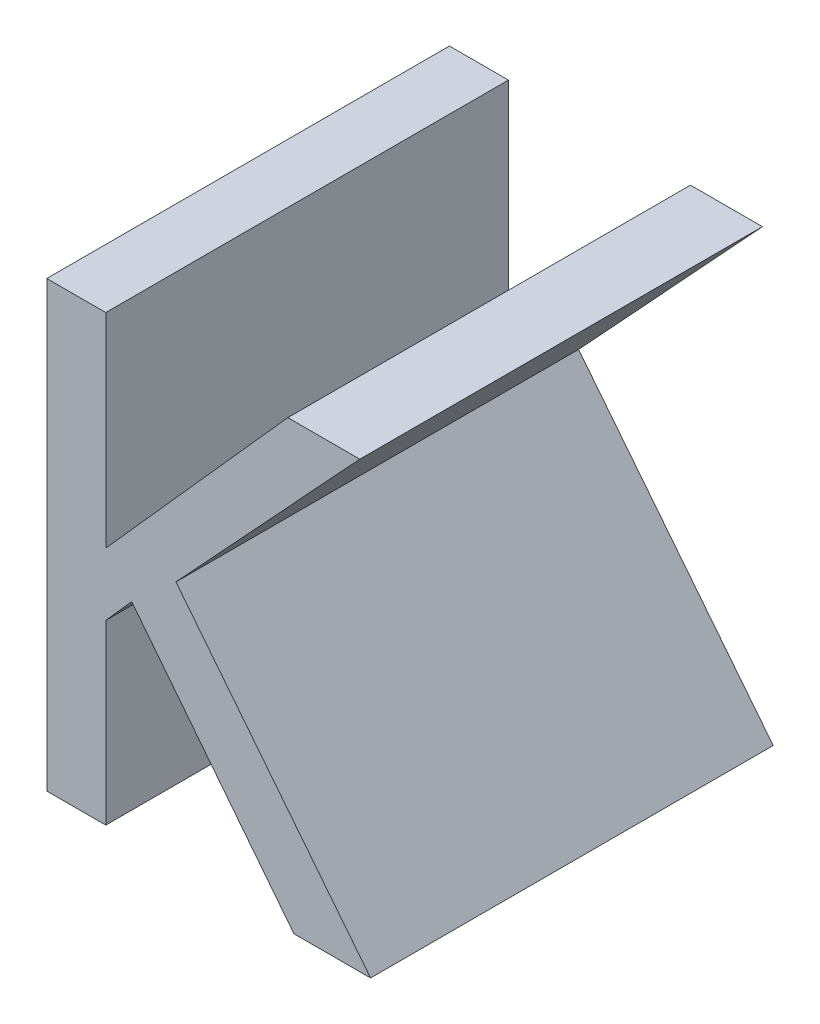
ISO-10303-21;
HEADER;
FILE_DESCRIPTION(('STEP AP214'),'2;1');
FILE_NAME('part.step','',(''),(''),'','','');
FILE_SCHEMA(('AUTOMOTIVE_DESIGN { 1 0 10303 214 1 1 1 1 }'));
ENDSEC;
DATA;
#1=APPLICATION_CONTEXT('core data for automotive mechanical design processes');
#2=APPLICATION_PROTOCOL_DEFINITION('international standard','automotive_design',2000,#1);
#3=PRODUCT_CONTEXT('',#1,'mechanical');
#4=PRODUCT('Part','Part','',(#3));
#5=PRODUCT_RELATED_PRODUCT_CATEGORY('part','',(#4));
#6=PRODUCT_DEFINITION_FORMATION('','',#4);
#7=PRODUCT_DEFINITION_CONTEXT('part definition',#1,'design');
#8=PRODUCT_DEFINITION('design','',#6,#7);
#9=PRODUCT_DEFINITION_SHAPE('','',#8);
#10=(LENGTH_UNIT() NAMED_UNIT(*) SI_UNIT(.MILLI.,.METRE.));
#11=(NAMED_UNIT(*) PLANE_ANGLE_UNIT() SI_UNIT($,.RADIAN.));
#12=(NAMED_UNIT(*) SI_UNIT($,.STERADIAN.) SOLID_ANGLE_UNIT());
#13=UNCERTAINTY_MEASURE_WITH_UNIT(LENGTH_MEASURE(1.E-05),#10,'distance_accuracy_value','');
#14=(GEOMETRIC_REPRESENTATION_CONTEXT(3) GLOBAL_UNCERTAINTY_ASSIGNED_CONTEXT((#13)) GLOBAL_UNIT_ASSIGNED_CONTEXT((#10,
#11,#12)) REPRESENTATION_CONTEXT('',''));
#15=CARTESIAN_POINT('',(0.,0.,0.));
#16=DIRECTION('',(0.,0.,1.));
#17=DIRECTION('',(1.,0.,0.));
#18=AXIS2_PLACEMENT_3D('',#15,#16,#17);
#19=CARTESIAN_POINT('',(-0.505727080254075,-0.750246731700096,0.));
#20=DIRECTION('',(-0.786318338822422,-0.617821551931904,0.));
#21=DIRECTION('',(0.617821551931904,-0.786318338822422,0.));
#22=AXIS2_PLACEMENT_3D('',#19,#20,#21);
#23=PLANE('',#22);
#24=DIRECTION('',(-0.617821551931904,0.786318338822422,0.));
#25=VECTOR('',#24,1.);
#26=CARTESIAN_POINT('',(-0.465433116202386,-0.801529958674972,0.));
#27=LINE('',#26,#25);
#28=CARTESIAN_POINT('',(-0.465433116202386,-0.801529958674972,0.));
#29=VERTEX_POINT('',#28);
#30=CARTESIAN_POINT('',(-0.505727080254075,-0.750246731700096,0.));
#31=VERTEX_POINT('',#30);
#32=EDGE_CURVE('E11',#29,#31,#27,.T.);
#33=ORIENTED_EDGE('',*,*,#32,.F.);
#34=DIRECTION('',(0.,0.,1.));
#35=VECTOR('',#34,1.);
#36=CARTESIAN_POINT('',(-0.465433116202386,-0.801529958674972,0.));
#37=LINE('',#36,#35);
#38=CARTESIAN_POINT('',(-0.465433116202386,-0.801529958674972,0.1));
#39=VERTEX_POINT('',#38);
#40=EDGE_CURVE('E201',#29,#39,#37,.T.);
#41=ORIENTED_EDGE('',*,*,#40,.T.);
#42=DIRECTION('',(0.617821551931903,-0.786318338822423,0.));
#43=VECTOR('',#42,1.);
#44=CARTESIAN_POINT('',(-0.505727080254075,-0.750246731700096,0.1));
#45=LINE('',#44,#43);
#46=CARTESIAN_POINT('',(-0.505727080254075,-0.750246731700096,0.1));
#47=VERTEX_POINT('',#46);
#48=EDGE_CURVE('E127',#47,#39,#45,.T.);
#49=ORIENTED_EDGE('',*,*,#48,.F.);
#50=DIRECTION('',(0.,0.,1.));
#51=VECTOR('',#50,1.);
#52=CARTESIAN_POINT('',(-0.505727080254075,-0.750246731700096,0.));
#53=LINE('',#52,#51);
#54=EDGE_CURVE('E196',#31,#47,#53,.T.);
#55=ORIENTED_EDGE('',*,*,#54,.F.);
#56=EDGE_LOOP('',(#33,#41,#49,#55));
#57=FACE_BOUND('',#56,.T.);
#58=ADVANCED_FACE('F17',(#57),#23,.T.);
#59=CARTESIAN_POINT('',(-0.512159819526185,-0.757483563381219,0.));
#60=DIRECTION('',(0.747409318683659,-0.664363838829921,0.));
#61=DIRECTION('',(0.664363838829921,0.747409318683659,0.));
#62=AXIS2_PLACEMENT_3D('',#59,#60,#61);
#63=PLANE('',#62);
#64=DIRECTION('',(-0.66436383882992,-0.747409318683659,0.));
#65=VECTOR('',#64,1.);
#66=CARTESIAN_POINT('',(-0.505727080254075,-0.750246731700096,0.));
#67=LINE('',#66,#65);
#68=CARTESIAN_POINT('',(-0.512159819526185,-0.757483563381219,0.));
#69=VERTEX_POINT('',#68);
#70=EDGE_CURVE('E24',#31,#69,#67,.T.);
#71=ORIENTED_EDGE('',*,*,#70,.F.);
#72=ORIENTED_EDGE('',*,*,#54,.T.);
#73=DIRECTION('',(0.664363838829926,0.747409318683654,0.));
#74=VECTOR('',#73,1.);
#75=CARTESIAN_POINT('',(-0.512159819526185,-0.757483563381219,0.1));
#76=LINE('',#75,#74);
#77=CARTESIAN_POINT('',(-0.512159819526185,-0.757483563381219,0.1));
#78=VERTEX_POINT('',#77);
#79=EDGE_CURVE('E188',#78,#47,#76,.T.);
#80=ORIENTED_EDGE('',*,*,#79,.F.);
#81=DIRECTION('',(0.,0.,1.));
#82=VECTOR('',#81,1.);
#83=CARTESIAN_POINT('',(-0.512159819526185,-0.757483563381219,0.));
#84=LINE('',#83,#82);
#85=EDGE_CURVE('E190',#69,#78,#84,.T.);
#86=ORIENTED_EDGE('',*,*,#85,.F.);
#87=EDGE_LOOP('',(#71,#72,#80,#86));
#88=FACE_BOUND('',#87,.T.);
#89=ADVANCED_FACE('F206',(#88),#63,.T.);
#90=CARTESIAN_POINT('',(-0.512159819526185,-0.801529958674972,0.));
#91=DIRECTION('',(1.,0.,0.));
#92=DIRECTION('',(0.,1.,0.));
#93=AXIS2_PLACEMENT_3D('',#90,#91,#92);
#94=PLANE('',#93);
#95=DIRECTION('',(0.,-1.,0.));
#96=VECTOR('',#95,1.);
#97=CARTESIAN_POINT('',(-0.512159819526185,-0.757483563381219,0.));
#98=LINE('',#97,#96);
#99=CARTESIAN_POINT('',(-0.512159819526185,-0.801529958674972,0.));
#100=VERTEX_POINT('',#99);
#101=EDGE_CURVE('E198',#69,#100,#98,.T.);
#102=ORIENTED_EDGE('',*,*,#101,.F.);
#103=ORIENTED_EDGE('',*,*,#85,.T.);
#104=DIRECTION('',(0.,1.,0.));
#105=VECTOR('',#104,1.);
#106=CARTESIAN_POINT('',(-0.512159819526185,-0.801529958674972,0.1));
#107=LINE('',#106,#105);
#108=CARTESIAN_POINT('',(-0.512159819526185,-0.801529958674972,0.1));
#109=VERTEX_POINT('',#108);
#110=EDGE_CURVE('E180',#109,#78,#107,.T.);
#111=ORIENTED_EDGE('',*,*,#110,.F.);
#112=DIRECTION('',(0.,0.,1.));
#113=VECTOR('',#112,1.);
#114=CARTESIAN_POINT('',(-0.512159819526185,-0.801529958674972,0.));
#115=LINE('',#114,#113);
#116=EDGE_CURVE('E183',#100,#109,#115,.T.);
#117=ORIENTED_EDGE('',*,*,#116,.F.);
#118=EDGE_LOOP('',(#102,#103,#111,#117));
#119=FACE_BOUND('',#118,.T.);
#120=ADVANCED_FACE('F208',(#119),#94,.T.);
#121=CARTESIAN_POINT('',(-0.526812170090435,-0.801529958674972,0.));
#122=DIRECTION('',(0.,-1.,0.));
#123=DIRECTION('',(1.,0.,0.));
#124=AXIS2_PLACEMENT_3D('',#121,#122,#123);
#125=PLANE('',#124);
#126=DIRECTION('',(-1.,0.,0.));
#127=VECTOR('',#126,1.);
#128=CARTESIAN_POINT('',(-0.512159819526185,-0.801529958674972,0.));
#129=LINE('',#128,#127);
#130=CARTESIAN_POINT('',(-0.526812170090435,-0.801529958674972,0.));
#131=VERTEX_POINT('',#130);
#132=EDGE_CURVE('E192',#100,#131,#129,.T.);
#133=ORIENTED_EDGE('',*,*,#132,.F.);
#134=ORIENTED_EDGE('',*,*,#116,.T.);
#135=DIRECTION('',(1.,0.,0.));
#136=VECTOR('',#135,1.);
#137=CARTESIAN_POINT('',(-0.526812170090435,-0.801529958674972,0.1));
#138=LINE('',#137,#136);
#139=CARTESIAN_POINT('',(-0.526812170090435,-0.801529958674972,0.1));
#140=VERTEX_POINT('',#139);
#141=EDGE_CURVE('E172',#140,#109,#138,.T.);
#142=ORIENTED_EDGE('',*,*,#141,.F.);
#143=DIRECTION('',(0.,0.,1.));
#144=VECTOR('',#143,1.);
#145=CARTESIAN_POINT('',(-0.526812170090435,-0.801529958674972,0.));
#146=LINE('',#145,#144);
#147=EDGE_CURVE('E175',#131,#140,#146,.T.);
#148=ORIENTED_EDGE('',*,*,#147,.F.);
#149=EDGE_LOOP('',(#133,#134,#142,#148));
#150=FACE_BOUND('',#149,.T.);
#151=ADVANCED_FACE('F212',(#150),#125,.T.);
#152=CARTESIAN_POINT('',(-0.526812170090435,-0.691279955039089,0.));
#153=DIRECTION('',(-1.,0.,0.));
#154=DIRECTION('',(0.,-1.,0.));
#155=AXIS2_PLACEMENT_3D('',#152,#153,#154);
#156=PLANE('',#155);
#157=DIRECTION('',(0.,1.,0.));
#158=VECTOR('',#157,1.);
#159=CARTESIAN_POINT('',(-0.526812170090435,-0.801529958674972,0.));
#160=LINE('',#159,#158);
#161=CARTESIAN_POINT('',(-0.526812170090435,-0.691279955039089,0.));
#162=VERTEX_POINT('',#161);
#163=EDGE_CURVE('E185',#131,#162,#160,.T.);
#164=ORIENTED_EDGE('',*,*,#163,.F.);
#165=ORIENTED_EDGE('',*,*,#147,.T.);
#166=DIRECTION('',(0.,-1.,0.));
#167=VECTOR('',#166,1.);
#168=CARTESIAN_POINT('',(-0.526812170090435,-0.691279955039089,0.1));
#169=LINE('',#168,#167);
#170=CARTESIAN_POINT('',(-0.526812170090435,-0.691279955039089,0.1));
#171=VERTEX_POINT('',#170);
#172=EDGE_CURVE('E164',#171,#140,#169,.T.);
#173=ORIENTED_EDGE('',*,*,#172,.F.);
#174=DIRECTION('',(0.,0.,1.));
#175=VECTOR('',#174,1.);
#176=CARTESIAN_POINT('',(-0.526812170090435,-0.691279955039089,0.));
#177=LINE('',#176,#175);
#178=EDGE_CURVE('E167',#162,#171,#177,.T.);
#179=ORIENTED_EDGE('',*,*,#178,.F.);
#180=EDGE_LOOP('',(#164,#165,#173,#179));
#181=FACE_BOUND('',#180,.T.);
#182=ADVANCED_FACE('F216',(#181),#156,.T.);
#183=CARTESIAN_POINT('',(-0.512159819526185,-0.691279955039089,0.));
#184=DIRECTION('',(0.,1.,0.));
#185=DIRECTION('',(-1.,0.,0.));
#186=AXIS2_PLACEMENT_3D('',#183,#184,#185);
#187=PLANE('',#186);
#188=DIRECTION('',(1.,0.,0.));
#189=VECTOR('',#188,1.);
#190=CARTESIAN_POINT('',(-0.526812170090435,-0.691279955039089,0.));
#191=LINE('',#190,#189);
#192=CARTESIAN_POINT('',(-0.512159819526185,-0.691279955039089,0.));
#193=VERTEX_POINT('',#192);
#194=EDGE_CURVE('E177',#162,#193,#191,.T.);
#195=ORIENTED_EDGE('',*,*,#194,.F.);
#196=ORIENTED_EDGE('',*,*,#178,.T.);
#197=DIRECTION('',(-1.,0.,0.));
#198=VECTOR('',#197,1.);
#199=CARTESIAN_POINT('',(-0.512159819526185,-0.691279955039089,0.1));
#200=LINE('',#199,#198);
#201=CARTESIAN_POINT('',(-0.512159819526185,-0.691279955039089,0.1));
#202=VERTEX_POINT('',#201);
#203=EDGE_CURVE('E156',#202,#171,#200,.T.);
#204=ORIENTED_EDGE('',*,*,#203,.F.);
#205=DIRECTION('',(0.,0.,1.));
#206=VECTOR('',#205,1.);
#207=CARTESIAN_POINT('',(-0.512159819526185,-0.691279955039089,0.));
#208=LINE('',#207,#206);
#209=EDGE_CURVE('E159',#193,#202,#208,.T.);
#210=ORIENTED_EDGE('',*,*,#209,.F.);
#211=EDGE_LOOP('',(#195,#196,#204,#210));
#212=FACE_BOUND('',#211,.T.);
#213=ADVANCED_FACE('F220',(#212),#187,.T.);
#214=CARTESIAN_POINT('',(-0.512159819526185,-0.741937776806954,0.));
#215=DIRECTION('',(1.,0.,0.));
#216=DIRECTION('',(0.,1.,0.));
#217=AXIS2_PLACEMENT_3D('',#214,#215,#216);
#218=PLANE('',#217);
#219=DIRECTION('',(0.,-1.,0.));
#220=VECTOR('',#219,1.);
#221=CARTESIAN_POINT('',(-0.512159819526185,-0.691279955039089,0.));
#222=LINE('',#221,#220);
#223=CARTESIAN_POINT('',(-0.512159819526185,-0.741937776806954,0.));
#224=VERTEX_POINT('',#223);
#225=EDGE_CURVE('E169',#193,#224,#222,.T.);
#226=ORIENTED_EDGE('',*,*,#225,.F.);
#227=ORIENTED_EDGE('',*,*,#209,.T.);
#228=DIRECTION('',(0.,1.,0.));
#229=VECTOR('',#228,1.);
#230=CARTESIAN_POINT('',(-0.512159819526185,-0.741937776806954,0.1));
#231=LINE('',#230,#229);
#232=CARTESIAN_POINT('',(-0.512159819526185,-0.741937776806954,0.1));
#233=VERTEX_POINT('',#232);
#234=EDGE_CURVE('E148',#233,#202,#231,.T.);
#235=ORIENTED_EDGE('',*,*,#234,.F.);
#236=DIRECTION('',(0.,0.,1.));
#237=VECTOR('',#236,1.);
#238=CARTESIAN_POINT('',(-0.512159819526185,-0.741937776806954,0.));
#239=LINE('',#238,#237);
#240=EDGE_CURVE('E151',#224,#233,#239,.T.);
#241=ORIENTED_EDGE('',*,*,#240,.F.);
#242=EDGE_LOOP('',(#226,#227,#235,#241));
#243=FACE_BOUND('',#242,.T.);
#244=ADVANCED_FACE('F224',(#243),#218,.T.);
#245=CARTESIAN_POINT('',(-0.466951957419412,-0.691279955039089,0.));
#246=DIRECTION('',(-0.746101072885279,0.665832703491977,0.));
#247=DIRECTION('',(-0.665832703491977,-0.746101072885279,0.));
#248=AXIS2_PLACEMENT_3D('',#245,#246,#247);
#249=PLANE('',#248);
#250=DIRECTION('',(0.665832703491978,0.746101072885279,0.));
#251=VECTOR('',#250,1.);
#252=CARTESIAN_POINT('',(-0.512159819526185,-0.741937776806954,0.));
#253=LINE('',#252,#251);
#254=CARTESIAN_POINT('',(-0.466951957419412,-0.691279955039089,0.));
#255=VERTEX_POINT('',#254);
#256=EDGE_CURVE('E161',#224,#255,#253,.T.);
#257=ORIENTED_EDGE('',*,*,#256,.F.);
#258=ORIENTED_EDGE('',*,*,#240,.T.);
#259=DIRECTION('',(-0.665832703491978,-0.746101072885279,0.));
#260=VECTOR('',#259,1.);
#261=CARTESIAN_POINT('',(-0.466951957419413,-0.691279955039089,0.1));
#262=LINE('',#261,#260);
#263=CARTESIAN_POINT('',(-0.466951957419412,-0.691279955039089,0.1));
#264=VERTEX_POINT('',#263);
#265=EDGE_CURVE('E140',#264,#233,#262,.T.);
#266=ORIENTED_EDGE('',*,*,#265,.F.);
#267=DIRECTION('',(0.,0.,1.));
#268=VECTOR('',#267,1.);
#269=CARTESIAN_POINT('',(-0.466951957419412,-0.691279955039089,0.));
#270=LINE('',#269,#268);
#271=EDGE_CURVE('E143',#255,#264,#270,.T.);
#272=ORIENTED_EDGE('',*,*,#271,.F.);
#273=EDGE_LOOP('',(#257,#258,#266,#272));
#274=FACE_BOUND('',#273,.T.);
#275=ADVANCED_FACE('F228',(#274),#249,.T.);
#276=CARTESIAN_POINT('',(-0.449083237219107,-0.691279955039089,0.));
#277=DIRECTION('',(0.,1.,0.));
#278=DIRECTION('',(-1.,0.,0.));
#279=AXIS2_PLACEMENT_3D('',#276,#277,#278);
#280=PLANE('',#279);
#281=DIRECTION('',(1.,0.,0.));
#282=VECTOR('',#281,1.);
#283=CARTESIAN_POINT('',(-0.466951957419412,-0.691279955039089,0.));
#284=LINE('',#283,#282);
#285=CARTESIAN_POINT('',(-0.449083237219107,-0.691279955039089,0.));
#286=VERTEX_POINT('',#285);
#287=EDGE_CURVE('E153',#255,#286,#284,.T.);
#288=ORIENTED_EDGE('',*,*,#287,.F.);
#289=ORIENTED_EDGE('',*,*,#271,.T.);
#290=DIRECTION('',(-1.,0.,0.));
#291=VECTOR('',#290,1.);
#292=CARTESIAN_POINT('',(-0.449083237219107,-0.691279955039089,0.1));
#293=LINE('',#292,#291);
#294=CARTESIAN_POINT('',(-0.449083237219107,-0.691279955039089,0.1));
#295=VERTEX_POINT('',#294);
#296=EDGE_CURVE('E133',#295,#264,#293,.T.);
#297=ORIENTED_EDGE('',*,*,#296,.F.);
#298=DIRECTION('',(0.,0.,1.));
#299=VECTOR('',#298,1.);
#300=CARTESIAN_POINT('',(-0.449083237219107,-0.691279955039089,0.));
#301=LINE('',#300,#299);
#302=EDGE_CURVE('E136',#286,#295,#301,.T.);
#303=ORIENTED_EDGE('',*,*,#302,.F.);
#304=EDGE_LOOP('',(#288,#289,#297,#303));
#305=FACE_BOUND('',#304,.T.);
#306=ADVANCED_FACE('F232',(#305),#280,.T.);
#307=CARTESIAN_POINT('',(-0.494737817330887,-0.74050827919093,0.));
#308=DIRECTION('',(0.73321990323995,-0.679991598104563,0.));
#309=DIRECTION('',(0.679991598104563,0.73321990323995,0.));
#310=AXIS2_PLACEMENT_3D('',#307,#308,#309);
#311=PLANE('',#310);
#312=DIRECTION('',(-0.679991598104564,-0.73321990323995,0.));
#313=VECTOR('',#312,1.);
#314=CARTESIAN_POINT('',(-0.449083237219107,-0.691279955039089,0.));
#315=LINE('',#314,#313);
#316=CARTESIAN_POINT('',(-0.494737817330887,-0.74050827919093,0.));
#317=VERTEX_POINT('',#316);
#318=EDGE_CURVE('E145',#286,#317,#315,.T.);
#319=ORIENTED_EDGE('',*,*,#318,.F.);
#320=ORIENTED_EDGE('',*,*,#302,.T.);
#321=DIRECTION('',(0.679991598104563,0.73321990323995,0.));
#322=VECTOR('',#321,1.);
#323=CARTESIAN_POINT('',(-0.494737817330887,-0.74050827919093,0.1));
#324=LINE('',#323,#322);
#325=CARTESIAN_POINT('',(-0.494737817330887,-0.74050827919093,0.1));
#326=VERTEX_POINT('',#325);
#327=EDGE_CURVE('E113',#326,#295,#324,.T.);
#328=ORIENTED_EDGE('',*,*,#327,.F.);
#329=DIRECTION('',(0.,0.,1.));
#330=VECTOR('',#329,1.);
#331=CARTESIAN_POINT('',(-0.494737817330887,-0.74050827919093,0.));
#332=LINE('',#331,#330);
#333=EDGE_CURVE('E119',#317,#326,#332,.T.);
#334=ORIENTED_EDGE('',*,*,#333,.F.);
#335=EDGE_LOOP('',(#319,#320,#328,#334));
#336=FACE_BOUND('',#335,.T.);
#337=ADVANCED_FACE('F235',(#336),#311,.T.);
#338=CARTESIAN_POINT('',(-0.446402929189061,-0.801529958674972,0.));
#339=DIRECTION('',(0.783882889412984,0.620908701570168,0.));
#340=DIRECTION('',(-0.620908701570168,0.783882889412984,0.));
#341=AXIS2_PLACEMENT_3D('',#338,#339,#340);
#342=PLANE('',#341);
#343=DIRECTION('',(0.620908701570168,-0.783882889412984,0.));
#344=VECTOR('',#343,1.);
#345=CARTESIAN_POINT('',(-0.494737817330887,-0.74050827919093,0.));
#346=LINE('',#345,#344);
#347=CARTESIAN_POINT('',(-0.446402929189061,-0.801529958674972,0.));
#348=VERTEX_POINT('',#347);
#349=EDGE_CURVE('E138',#317,#348,#346,.T.);
#350=ORIENTED_EDGE('',*,*,#349,.F.);
#351=ORIENTED_EDGE('',*,*,#333,.T.);
#352=DIRECTION('',(-0.620908701570168,0.783882889412984,0.));
#353=VECTOR('',#352,1.);
#354=CARTESIAN_POINT('',(-0.446402929189061,-0.801529958674972,0.1));
#355=LINE('',#354,#353);
#356=CARTESIAN_POINT('',(-0.446402929189061,-0.801529958674972,0.1));
#357=VERTEX_POINT('',#356);
#358=EDGE_CURVE('E114',#357,#326,#355,.T.);
#359=ORIENTED_EDGE('',*,*,#358,.F.);
#360=DIRECTION('',(0.,0.,1.));
#361=VECTOR('',#360,1.);
#362=CARTESIAN_POINT('',(-0.446402929189061,-0.801529958674972,0.));
#363=LINE('',#362,#361);
#364=EDGE_CURVE('E103',#348,#357,#363,.T.);
#365=ORIENTED_EDGE('',*,*,#364,.F.);
#366=EDGE_LOOP('',(#350,#351,#359,#365));
#367=FACE_BOUND('',#366,.T.);
#368=ADVANCED_FACE('F117',(#367),#342,.T.);
#369=CARTESIAN_POINT('',(-0.465433116202386,-0.801529958674972,0.));
#370=DIRECTION('',(0.,-1.,0.));
#371=DIRECTION('',(1.,0.,0.));
#372=AXIS2_PLACEMENT_3D('',#369,#370,#371);
#373=PLANE('',#372);
#374=DIRECTION('',(-1.,0.,0.));
#375=VECTOR('',#374,1.);
#376=CARTESIAN_POINT('',(-0.446402929189061,-0.801529958674972,0.));
#377=LINE('',#376,#375);
#378=EDGE_CURVE('E110',#348,#29,#377,.T.);
#379=ORIENTED_EDGE('',*,*,#378,.F.);
#380=ORIENTED_EDGE('',*,*,#364,.T.);
#381=DIRECTION('',(1.,0.,0.));
#382=VECTOR('',#381,1.);
#383=CARTESIAN_POINT('',(-0.465433116202386,-0.801529958674972,0.1));
#384=LINE('',#383,#382);
#385=EDGE_CURVE('E108',#39,#357,#384,.T.);
#386=ORIENTED_EDGE('',*,*,#385,.F.);
#387=ORIENTED_EDGE('',*,*,#40,.F.);
#388=EDGE_LOOP('',(#379,#380,#386,#387));
#389=FACE_BOUND('',#388,.T.);
#390=ADVANCED_FACE('F105',(#389),#373,.T.);
#391=CARTESIAN_POINT('',(-0.495258415481337,-0.746140718600297,0.));
#392=DIRECTION('',(0.,0.,1.));
#393=DIRECTION('',(1.,0.,0.));
#394=AXIS2_PLACEMENT_3D('',#391,#392,#393);
#395=PLANE('',#394);
#396=ORIENTED_EDGE('',*,*,#378,.T.);
#397=ORIENTED_EDGE('',*,*,#32,.T.);
#398=ORIENTED_EDGE('',*,*,#70,.T.);
#399=ORIENTED_EDGE('',*,*,#101,.T.);
#400=ORIENTED_EDGE('',*,*,#132,.T.);
#401=ORIENTED_EDGE('',*,*,#163,.T.);
#402=ORIENTED_EDGE('',*,*,#194,.T.);
#403=ORIENTED_EDGE('',*,*,#225,.T.);
#404=ORIENTED_EDGE('',*,*,#256,.T.);
#405=ORIENTED_EDGE('',*,*,#287,.T.);
#406=ORIENTED_EDGE('',*,*,#318,.T.);
#407=ORIENTED_EDGE('',*,*,#349,.T.);
#408=EDGE_LOOP('',(#396,#397,#398,#399,#400,#401,#402,#403,#404,#405,#406,#407));
#409=FACE_BOUND('',#408,.T.);
#410=ADVANCED_FACE('F203',(#409),#395,.F.);
#411=CARTESIAN_POINT('',(-0.495258415481337,-0.746140718600297,0.1));
#412=DIRECTION('',(0.,0.,1.));
#413=DIRECTION('',(1.,0.,0.));
#414=AXIS2_PLACEMENT_3D('',#411,#412,#413);
#415=PLANE('',#414);
#416=ORIENTED_EDGE('',*,*,#385,.T.);
#417=ORIENTED_EDGE('',*,*,#358,.T.);
#418=ORIENTED_EDGE('',*,*,#327,.T.);
#419=ORIENTED_EDGE('',*,*,#296,.T.);
#420=ORIENTED_EDGE('',*,*,#265,.T.);
#421=ORIENTED_EDGE('',*,*,#234,.T.);
#422=ORIENTED_EDGE('',*,*,#203,.T.);
#423=ORIENTED_EDGE('',*,*,#172,.T.);
#424=ORIENTED_EDGE('',*,*,#141,.T.);
#425=ORIENTED_EDGE('',*,*,#110,.T.);
#426=ORIENTED_EDGE('',*,*,#79,.T.);
#427=ORIENTED_EDGE('',*,*,#48,.T.);
#428=EDGE_LOOP('',(#416,#417,#418,#419,#420,#421,#422,#423,#424,#425,#426,#427));
#429=FACE_BOUND('',#428,.T.);
#430=ADVANCED_FACE('F124',(#429),#415,.T.);
#431=CLOSED_SHELL('',(#58,#89,#120,#151,#182,#213,#244,#275,#306,#337,#368,#390,#410,#430));
#432=MANIFOLD_SOLID_BREP('B1',#431);
#433=ADVANCED_BREP_SHAPE_REPRESENTATION('',(#18,#432),#14);
#434=SHAPE_DEFINITION_REPRESENTATION(#9,#433);
ENDSEC;
END-ISO-10303-21;
